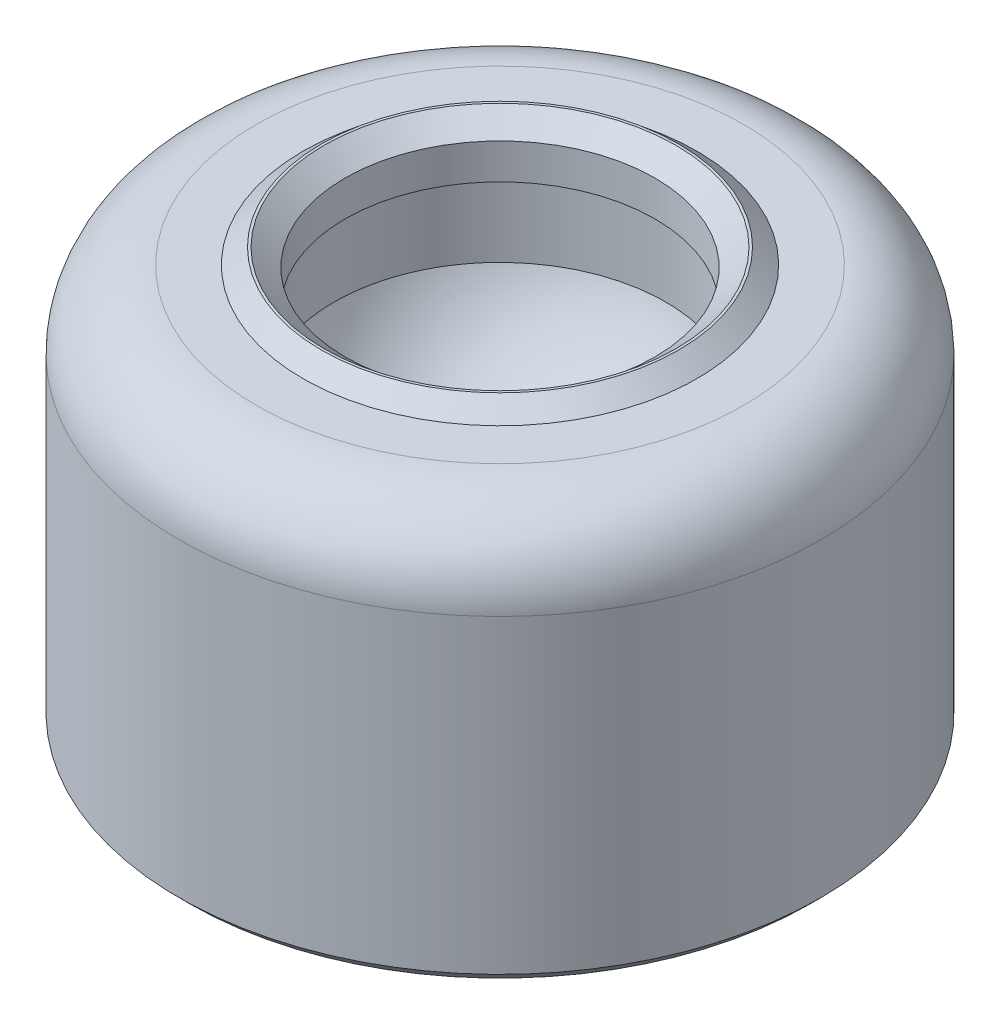
ISO-10303-21;
HEADER;
FILE_DESCRIPTION(('STEP AP214'),'2;1');
FILE_NAME('part.step','',(''),(''),'','','');
FILE_SCHEMA(('AUTOMOTIVE_DESIGN { 1 0 10303 214 1 1 1 1 }'));
ENDSEC;
DATA;
#1=APPLICATION_CONTEXT('core data for automotive mechanical design processes');
#2=APPLICATION_PROTOCOL_DEFINITION('international standard','automotive_design',2000,#1);
#3=PRODUCT_CONTEXT('',#1,'mechanical');
#4=PRODUCT('Part','Part','',(#3));
#5=PRODUCT_RELATED_PRODUCT_CATEGORY('part','',(#4));
#6=PRODUCT_DEFINITION_FORMATION('','',#4);
#7=PRODUCT_DEFINITION_CONTEXT('part definition',#1,'design');
#8=PRODUCT_DEFINITION('design','',#6,#7);
#9=PRODUCT_DEFINITION_SHAPE('','',#8);
#10=(LENGTH_UNIT() NAMED_UNIT(*) SI_UNIT(.MILLI.,.METRE.));
#11=(NAMED_UNIT(*) PLANE_ANGLE_UNIT() SI_UNIT($,.RADIAN.));
#12=(NAMED_UNIT(*) SI_UNIT($,.STERADIAN.) SOLID_ANGLE_UNIT());
#13=UNCERTAINTY_MEASURE_WITH_UNIT(LENGTH_MEASURE(1.E-05),#10,'distance_accuracy_value','');
#14=(GEOMETRIC_REPRESENTATION_CONTEXT(3) GLOBAL_UNCERTAINTY_ASSIGNED_CONTEXT((#13)) GLOBAL_UNIT_ASSIGNED_CONTEXT((#10,
#11,#12)) REPRESENTATION_CONTEXT('',''));
#15=CARTESIAN_POINT('',(0.,0.,0.));
#16=DIRECTION('',(0.,0.,1.));
#17=DIRECTION('',(1.,0.,0.));
#18=AXIS2_PLACEMENT_3D('',#15,#16,#17);
#19=CARTESIAN_POINT('',(-14.,3.,0.));
#20=DIRECTION('',(0.,-1.,0.));
#21=DIRECTION('',(1.,0.,0.));
#22=AXIS2_PLACEMENT_3D('',#19,#20,#21);
#23=PLANE('',#22);
#24=CARTESIAN_POINT('',(0.,2.99999999999999,0.));
#25=DIRECTION('',(0.,-1.,0.));
#26=DIRECTION('',(1.,0.,0.));
#27=AXIS2_PLACEMENT_3D('',#24,#25,#26);
#28=CIRCLE('',#27,14.);
#29=CARTESIAN_POINT('',(14.,2.99999999999998,0.));
#30=VERTEX_POINT('',#29);
#31=EDGE_CURVE('E78',#30,#30,#28,.T.);
#32=ORIENTED_EDGE('',*,*,#31,.T.);
#33=EDGE_LOOP('',(#32));
#34=FACE_BOUND('',#33,.T.);
#35=CARTESIAN_POINT('',(0.,2.99999999999999,0.));
#36=DIRECTION('',(0.,-1.,0.));
#37=DIRECTION('',(1.,0.,0.));
#38=AXIS2_PLACEMENT_3D('',#35,#36,#37);
#39=CIRCLE('',#38,10.2320508075689);
#40=CARTESIAN_POINT('',(10.2320508075689,2.99999999999999,0.));
#41=VERTEX_POINT('',#40);
#42=EDGE_CURVE('E165',#41,#41,#39,.T.);
#43=ORIENTED_EDGE('',*,*,#42,.F.);
#44=EDGE_LOOP('',(#43));
#45=FACE_BOUND('',#44,.T.);
#46=ADVANCED_FACE('F49',(#34,#45),#23,.T.);
#47=CARTESIAN_POINT('',(0.,18.6,0.));
#48=DIRECTION('',(1.,0.,0.));
#49=DIRECTION('',(0.,-1.,0.));
#50=AXIS2_PLACEMENT_3D('',#47,#48,#49);
#51=SPHERICAL_SURFACE('',#50,8.00000000000003);
#52=CARTESIAN_POINT('',(0.,15.8,0.));
#53=DIRECTION('',(0.,-1.,0.));
#54=DIRECTION('',(-1.,0.,0.));
#55=AXIS2_PLACEMENT_3D('',#52,#53,#54);
#56=CIRCLE('',#55,7.4939975980781);
#57=CARTESIAN_POINT('',(-7.49399759807809,15.8,0.));
#58=VERTEX_POINT('',#57);
#59=EDGE_CURVE('E84',#58,#58,#56,.T.);
#60=ORIENTED_EDGE('',*,*,#59,.F.);
#61=EDGE_LOOP('',(#60));
#62=FACE_BOUND('',#61,.T.);
#63=ADVANCED_FACE('F87',(#62),#51,.F.);
#64=CARTESIAN_POINT('',(0.,19.3,0.));
#65=DIRECTION('',(0.,-1.,0.));
#66=DIRECTION('',(1.,0.,0.));
#67=AXIS2_PLACEMENT_3D('',#64,#65,#66);
#68=CYLINDRICAL_SURFACE('',#67,7.4939975980781);
#69=CARTESIAN_POINT('',(0.,19.3,0.));
#70=DIRECTION('',(0.,-1.,0.));
#71=DIRECTION('',(-1.,0.,0.));
#72=AXIS2_PLACEMENT_3D('',#69,#70,#71);
#73=CIRCLE('',#72,7.4939975980781);
#74=CARTESIAN_POINT('',(-7.49399759807809,19.3,0.));
#75=VERTEX_POINT('',#74);
#76=EDGE_CURVE('E81',#75,#75,#73,.T.);
#77=ORIENTED_EDGE('',*,*,#76,.F.);
#78=EDGE_LOOP('',(#77));
#79=FACE_BOUND('',#78,.T.);
#80=ORIENTED_EDGE('',*,*,#59,.T.);
#81=EDGE_LOOP('',(#80));
#82=FACE_BOUND('',#81,.T.);
#83=ADVANCED_FACE('F91',(#79,#82),#68,.F.);
#84=CARTESIAN_POINT('',(0.,19.3,0.));
#85=DIRECTION('',(0.,1.,0.));
#86=DIRECTION('',(-1.,0.,0.));
#87=AXIS2_PLACEMENT_3D('',#84,#85,#86);
#88=PLANE('',#87);
#89=CARTESIAN_POINT('',(0.,19.3,0.));
#90=DIRECTION('',(0.,-1.,0.));
#91=DIRECTION('',(0.,0.,-1.));
#92=AXIS2_PLACEMENT_3D('',#89,#90,#91);
#93=CIRCLE('',#92,7.);
#94=CARTESIAN_POINT('',(0.,19.3,-7.));
#95=VERTEX_POINT('',#94);
#96=EDGE_CURVE('E152',#95,#95,#93,.T.);
#97=ORIENTED_EDGE('',*,*,#96,.F.);
#98=EDGE_LOOP('',(#97));
#99=FACE_BOUND('',#98,.T.);
#100=ORIENTED_EDGE('',*,*,#76,.T.);
#101=EDGE_LOOP('',(#100));
#102=FACE_BOUND('',#101,.T.);
#103=ADVANCED_FACE('F136',(#99,#102),#88,.F.);
#104=CARTESIAN_POINT('',(0.,19.3,0.));
#105=DIRECTION('',(0.,-1.,0.));
#106=DIRECTION('',(0.,0.,-1.));
#107=AXIS2_PLACEMENT_3D('',#104,#105,#106);
#108=CYLINDRICAL_SURFACE('',#107,7.00000000000001);
#109=CARTESIAN_POINT('',(0.,20.9,0.));
#110=DIRECTION('',(0.,1.,0.));
#111=DIRECTION('',(0.,0.,1.));
#112=AXIS2_PLACEMENT_3D('',#109,#110,#111);
#113=CIRCLE('',#112,7.00000000000001);
#114=CARTESIAN_POINT('',(0.,20.9,7.00000000000001));
#115=VERTEX_POINT('',#114);
#116=EDGE_CURVE('E72',#115,#115,#113,.T.);
#117=ORIENTED_EDGE('',*,*,#116,.T.);
#118=EDGE_LOOP('',(#117));
#119=FACE_BOUND('',#118,.T.);
#120=ORIENTED_EDGE('',*,*,#96,.T.);
#121=EDGE_LOOP('',(#120));
#122=FACE_BOUND('',#121,.T.);
#123=ADVANCED_FACE('F98',(#119,#122),#108,.F.);
#124=CARTESIAN_POINT('',(-8.9,21.,0.));
#125=DIRECTION('',(0.,1.,0.));
#126=DIRECTION('',(-1.,0.,0.));
#127=AXIS2_PLACEMENT_3D('',#124,#125,#126);
#128=PLANE('',#127);
#129=CARTESIAN_POINT('',(0.,21.,0.));
#130=DIRECTION('',(0.,1.,0.));
#131=DIRECTION('',(-1.,0.,0.));
#132=AXIS2_PLACEMENT_3D('',#129,#130,#131);
#133=CIRCLE('',#132,11.);
#134=CARTESIAN_POINT('',(-11.,21.,0.));
#135=VERTEX_POINT('',#134);
#136=EDGE_CURVE('E12',#135,#135,#133,.T.);
#137=ORIENTED_EDGE('',*,*,#136,.T.);
#138=EDGE_LOOP('',(#137));
#139=FACE_BOUND('',#138,.T.);
#140=CARTESIAN_POINT('',(0.,21.,0.));
#141=DIRECTION('',(0.,1.,0.));
#142=DIRECTION('',(-1.,0.,0.));
#143=AXIS2_PLACEMENT_3D('',#140,#141,#142);
#144=CIRCLE('',#143,8.90000000000001);
#145=CARTESIAN_POINT('',(-8.9,21.,0.));
#146=VERTEX_POINT('',#145);
#147=EDGE_CURVE('E161',#146,#146,#144,.T.);
#148=ORIENTED_EDGE('',*,*,#147,.F.);
#149=EDGE_LOOP('',(#148));
#150=FACE_BOUND('',#149,.T.);
#151=ADVANCED_FACE('F94',(#139,#150),#128,.T.);
#152=CARTESIAN_POINT('',(0.,18.6,0.));
#153=DIRECTION('',(0.,1.,0.));
#154=DIRECTION('',(-1.,0.,0.));
#155=AXIS2_PLACEMENT_3D('',#152,#153,#154);
#156=CYLINDRICAL_SURFACE('',#155,14.5);
#157=CARTESIAN_POINT('',(0.,17.5,0.));
#158=DIRECTION('',(0.,1.,0.));
#159=DIRECTION('',(-1.,0.,0.));
#160=AXIS2_PLACEMENT_3D('',#157,#158,#159);
#161=CIRCLE('',#160,14.5);
#162=CARTESIAN_POINT('',(-14.5,17.5,0.));
#163=VERTEX_POINT('',#162);
#164=EDGE_CURVE('E56',#163,#163,#161,.F.);
#165=ORIENTED_EDGE('',*,*,#164,.T.);
#166=EDGE_LOOP('',(#165));
#167=FACE_BOUND('',#166,.T.);
#168=CARTESIAN_POINT('',(0.,3.49999999999999,0.));
#169=DIRECTION('',(0.,-1.,0.));
#170=DIRECTION('',(1.,0.,0.));
#171=AXIS2_PLACEMENT_3D('',#168,#169,#170);
#172=CIRCLE('',#171,14.5);
#173=CARTESIAN_POINT('',(14.5,3.49999999999998,0.));
#174=VERTEX_POINT('',#173);
#175=EDGE_CURVE('E75',#174,#174,#172,.F.);
#176=ORIENTED_EDGE('',*,*,#175,.T.);
#177=EDGE_LOOP('',(#176));
#178=FACE_BOUND('',#177,.T.);
#179=ADVANCED_FACE('F97',(#167,#178),#156,.T.);
#180=CARTESIAN_POINT('',(0.,21.,0.));
#181=DIRECTION('',(0.,-1.,0.));
#182=DIRECTION('',(-1.,0.,0.));
#183=AXIS2_PLACEMENT_3D('',#180,#181,#182);
#184=CONICAL_SURFACE('',#183,8.90000000000001,0.872664625997164);
#185=CARTESIAN_POINT('',(0.,21.7,0.));
#186=DIRECTION('',(0.,1.,0.));
#187=DIRECTION('',(-1.,0.,0.));
#188=AXIS2_PLACEMENT_3D('',#185,#186,#187);
#189=CIRCLE('',#188,8.06577248518407);
#190=CARTESIAN_POINT('',(-8.06577248518407,21.7,0.));
#191=VERTEX_POINT('',#190);
#192=EDGE_CURVE('E157',#191,#191,#189,.T.);
#193=ORIENTED_EDGE('',*,*,#192,.F.);
#194=EDGE_LOOP('',(#193));
#195=FACE_BOUND('',#194,.T.);
#196=ORIENTED_EDGE('',*,*,#147,.T.);
#197=EDGE_LOOP('',(#196));
#198=FACE_BOUND('',#197,.T.);
#199=ADVANCED_FACE('F104',(#195,#198),#184,.T.);
#200=CARTESIAN_POINT('',(0.,21.7,0.));
#201=DIRECTION('',(0.,1.,0.));
#202=DIRECTION('',(-1.,0.,0.));
#203=AXIS2_PLACEMENT_3D('',#200,#201,#202);
#204=PLANE('',#203);
#205=CARTESIAN_POINT('',(0.,21.7,0.));
#206=DIRECTION('',(0.,1.,0.));
#207=DIRECTION('',(-1.,0.,0.));
#208=AXIS2_PLACEMENT_3D('',#205,#206,#207);
#209=CIRCLE('',#208,7.95340287407537);
#210=CARTESIAN_POINT('',(-7.95340287407537,21.7,0.));
#211=VERTEX_POINT('',#210);
#212=EDGE_CURVE('E69',#211,#211,#209,.F.);
#213=ORIENTED_EDGE('',*,*,#212,.T.);
#214=EDGE_LOOP('',(#213));
#215=FACE_BOUND('',#214,.T.);
#216=ORIENTED_EDGE('',*,*,#192,.T.);
#217=EDGE_LOOP('',(#216));
#218=FACE_BOUND('',#217,.T.);
#219=ADVANCED_FACE('F130',(#215,#218),#204,.T.);
#220=CARTESIAN_POINT('',(0.,0.999999999999997,0.));
#221=DIRECTION('',(0.,1.,0.));
#222=DIRECTION('',(-1.,0.,0.));
#223=AXIS2_PLACEMENT_3D('',#220,#221,#222);
#224=CYLINDRICAL_SURFACE('',#223,10.2320508075689);
#225=CARTESIAN_POINT('',(0.,2.,0.));
#226=DIRECTION('',(0.,-1.,0.));
#227=DIRECTION('',(1.,0.,0.));
#228=AXIS2_PLACEMENT_3D('',#225,#226,#227);
#229=CIRCLE('',#228,10.2320508075689);
#230=CARTESIAN_POINT('',(10.2320508075689,1.99999999999999,0.));
#231=VERTEX_POINT('',#230);
#232=EDGE_CURVE('E60',#231,#231,#229,.F.);
#233=ORIENTED_EDGE('',*,*,#232,.T.);
#234=EDGE_LOOP('',(#233));
#235=FACE_BOUND('',#234,.T.);
#236=ORIENTED_EDGE('',*,*,#42,.T.);
#237=EDGE_LOOP('',(#236));
#238=FACE_BOUND('',#237,.T.);
#239=ADVANCED_FACE('F125',(#235,#238),#224,.T.);
#240=CARTESIAN_POINT('',(0.,0.999999999999997,0.));
#241=DIRECTION('',(0.,-1.,0.));
#242=DIRECTION('',(1.,0.,0.));
#243=AXIS2_PLACEMENT_3D('',#240,#241,#242);
#244=PLANE('',#243);
#245=CARTESIAN_POINT('',(0.,0.999999999999997,0.));
#246=DIRECTION('',(0.,-1.,0.));
#247=DIRECTION('',(1.,0.,0.));
#248=AXIS2_PLACEMENT_3D('',#245,#246,#247);
#249=CIRCLE('',#248,9.23205080756886);
#250=CARTESIAN_POINT('',(9.23205080756886,0.999999999999991,0.));
#251=VERTEX_POINT('',#250);
#252=EDGE_CURVE('E64',#251,#251,#249,.T.);
#253=ORIENTED_EDGE('',*,*,#252,.T.);
#254=EDGE_LOOP('',(#253));
#255=FACE_BOUND('',#254,.T.);
#256=ADVANCED_FACE('F109',(#255),#244,.T.);
#257=CARTESIAN_POINT('',(0.,2.99999999999999,0.));
#258=DIRECTION('',(0.,1.,0.));
#259=DIRECTION('',(-1.,0.,0.));
#260=AXIS2_PLACEMENT_3D('',#257,#258,#259);
#261=CONICAL_SURFACE('',#260,14.,0.78539816339745);
#262=ORIENTED_EDGE('',*,*,#175,.F.);
#263=EDGE_LOOP('',(#262));
#264=FACE_BOUND('',#263,.T.);
#265=ORIENTED_EDGE('',*,*,#31,.F.);
#266=EDGE_LOOP('',(#265));
#267=FACE_BOUND('',#266,.T.);
#268=ADVANCED_FACE('F105',(#264,#267),#261,.T.);
#269=CARTESIAN_POINT('',(0.,20.9,0.));
#270=DIRECTION('',(0.,1.,0.));
#271=DIRECTION('',(0.,0.,1.));
#272=AXIS2_PLACEMENT_3D('',#269,#270,#271);
#273=CONICAL_SURFACE('',#272,7.00000000000001,0.872664625997172);
#274=ORIENTED_EDGE('',*,*,#212,.F.);
#275=EDGE_LOOP('',(#274));
#276=FACE_BOUND('',#275,.T.);
#277=ORIENTED_EDGE('',*,*,#116,.F.);
#278=EDGE_LOOP('',(#277));
#279=FACE_BOUND('',#278,.T.);
#280=ADVANCED_FACE('F108',(#276,#279),#273,.F.);
#281=CARTESIAN_POINT('',(0.,2.,0.));
#282=DIRECTION('',(0.,-1.,0.));
#283=DIRECTION('',(1.,0.,0.));
#284=AXIS2_PLACEMENT_3D('',#281,#282,#283);
#285=TOROIDAL_SURFACE('',#284,9.23205080756886,1.);
#286=ORIENTED_EDGE('',*,*,#232,.F.);
#287=EDGE_LOOP('',(#286));
#288=FACE_BOUND('',#287,.T.);
#289=ORIENTED_EDGE('',*,*,#252,.F.);
#290=EDGE_LOOP('',(#289));
#291=FACE_BOUND('',#290,.T.);
#292=ADVANCED_FACE('F112',(#288,#291),#285,.T.);
#293=CARTESIAN_POINT('',(0.,17.5,0.));
#294=DIRECTION('',(0.,1.,0.));
#295=DIRECTION('',(-1.,0.,0.));
#296=AXIS2_PLACEMENT_3D('',#293,#294,#295);
#297=TOROIDAL_SURFACE('',#296,11.,3.50000000000001);
#298=ORIENTED_EDGE('',*,*,#136,.F.);
#299=EDGE_LOOP('',(#298));
#300=FACE_BOUND('',#299,.T.);
#301=ORIENTED_EDGE('',*,*,#164,.F.);
#302=EDGE_LOOP('',(#301));
#303=FACE_BOUND('',#302,.T.);
#304=ADVANCED_FACE('F51',(#300,#303),#297,.T.);
#305=CLOSED_SHELL('',(#46,#63,#83,#103,#123,#151,#179,#199,#219,#239,#256,#268,#280,#292,#304));
#306=MANIFOLD_SOLID_BREP('B2',#305);
#307=ADVANCED_BREP_SHAPE_REPRESENTATION('',(#18,#306),#14);
#308=SHAPE_DEFINITION_REPRESENTATION(#9,#307);
ENDSEC;
END-ISO-10303-21;
